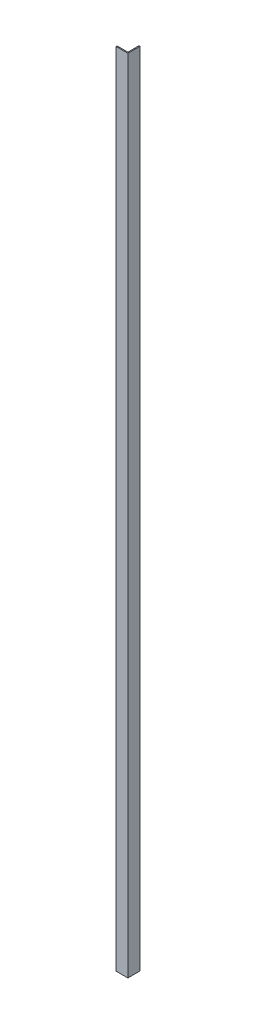
ISO-10303-21;
HEADER;
FILE_DESCRIPTION(('STEP AP214'),'2;1');
FILE_NAME('part.step','',(''),(''),'','','');
FILE_SCHEMA(('AUTOMOTIVE_DESIGN { 1 0 10303 214 1 1 1 1 }'));
ENDSEC;
DATA;
#1=APPLICATION_CONTEXT('core data for automotive mechanical design processes');
#2=APPLICATION_PROTOCOL_DEFINITION('international standard','automotive_design',2000,#1);
#3=PRODUCT_CONTEXT('',#1,'mechanical');
#4=PRODUCT('Part','Part','',(#3));
#5=PRODUCT_RELATED_PRODUCT_CATEGORY('part','',(#4));
#6=PRODUCT_DEFINITION_FORMATION('','',#4);
#7=PRODUCT_DEFINITION_CONTEXT('part definition',#1,'design');
#8=PRODUCT_DEFINITION('design','',#6,#7);
#9=PRODUCT_DEFINITION_SHAPE('','',#8);
#10=(LENGTH_UNIT() NAMED_UNIT(*) SI_UNIT(.MILLI.,.METRE.));
#11=(NAMED_UNIT(*) PLANE_ANGLE_UNIT() SI_UNIT($,.RADIAN.));
#12=(NAMED_UNIT(*) SI_UNIT($,.STERADIAN.) SOLID_ANGLE_UNIT());
#13=UNCERTAINTY_MEASURE_WITH_UNIT(LENGTH_MEASURE(1.E-05),#10,'distance_accuracy_value','');
#14=(GEOMETRIC_REPRESENTATION_CONTEXT(3) GLOBAL_UNCERTAINTY_ASSIGNED_CONTEXT((#13)) GLOBAL_UNIT_ASSIGNED_CONTEXT((#10,
#11,#12)) REPRESENTATION_CONTEXT('',''));
#15=CARTESIAN_POINT('',(0.,0.,0.));
#16=DIRECTION('',(0.,0.,1.));
#17=DIRECTION('',(1.,0.,0.));
#18=AXIS2_PLACEMENT_3D('',#15,#16,#17);
#19=CARTESIAN_POINT('',(0.,1220.,-1.5));
#20=DIRECTION('',(1.,0.,0.));
#21=DIRECTION('',(0.,0.,-1.));
#22=AXIS2_PLACEMENT_3D('',#19,#20,#21);
#23=PLANE('',#22);
#24=DIRECTION('',(0.,0.,1.));
#25=VECTOR('',#24,1.);
#26=CARTESIAN_POINT('',(0.,1220.,-1.5));
#27=LINE('',#26,#25);
#28=CARTESIAN_POINT('',(0.,1220.,-0.3));
#29=VERTEX_POINT('',#28);
#30=CARTESIAN_POINT('',(0.,1220.,0.));
#31=VERTEX_POINT('',#30);
#32=EDGE_CURVE('E117',#29,#31,#27,.T.);
#33=ORIENTED_EDGE('',*,*,#32,.F.);
#34=CARTESIAN_POINT('',(0.,-60.9999999999999,-0.3));
#35=CARTESIAN_POINT('',(0.,386.333333333333,-0.3));
#36=CARTESIAN_POINT('',(0.,833.666666666667,-0.3));
#37=CARTESIAN_POINT('',(0.,1281.,-0.3));
#38=(BOUNDED_CURVE() B_SPLINE_CURVE(3,(#34,#35,#36,#37),.UNSPECIFIED.,.F.,
.F.) B_SPLINE_CURVE_WITH_KNOTS((4,4),(-0.0609999999999999,1.281),
.UNSPECIFIED.) CURVE() GEOMETRIC_REPRESENTATION_ITEM() RATIONAL_B_SPLINE_CURVE((1.,1.,1.,1.)) REPRESENTATION_ITEM(''));
#39=CARTESIAN_POINT('',(0.,0.,-0.3));
#40=VERTEX_POINT('',#39);
#41=EDGE_CURVE('E231',#29,#40,#38,.F.);
#42=ORIENTED_EDGE('',*,*,#41,.T.);
#43=DIRECTION('',(0.,0.,1.));
#44=VECTOR('',#43,1.);
#45=CARTESIAN_POINT('',(0.,0.,-1.5));
#46=LINE('',#45,#44);
#47=CARTESIAN_POINT('',(0.,0.,0.));
#48=VERTEX_POINT('',#47);
#49=EDGE_CURVE('E139',#40,#48,#46,.T.);
#50=ORIENTED_EDGE('',*,*,#49,.T.);
#51=DIRECTION('',(0.,-1.,0.));
#52=VECTOR('',#51,1.);
#53=CARTESIAN_POINT('',(0.,1220.,0.));
#54=LINE('',#53,#52);
#55=EDGE_CURVE('E133',#31,#48,#54,.T.);
#56=ORIENTED_EDGE('',*,*,#55,.F.);
#57=EDGE_LOOP('',(#33,#42,#50,#56));
#58=FACE_BOUND('',#57,.T.);
#59=ADVANCED_FACE('F39',(#58),#23,.F.);
#60=CARTESIAN_POINT('',(0.,1220.,0.));
#61=DIRECTION('',(0.,0.,-1.));
#62=DIRECTION('',(-1.,0.,0.));
#63=AXIS2_PLACEMENT_3D('',#60,#61,#62);
#64=PLANE('',#63);
#65=DIRECTION('',(1.,0.,0.));
#66=VECTOR('',#65,1.);
#67=CARTESIAN_POINT('',(0.,0.,0.));
#68=LINE('',#67,#66);
#69=CARTESIAN_POINT('',(18.,0.,0.));
#70=VERTEX_POINT('',#69);
#71=EDGE_CURVE('E223',#48,#70,#68,.T.);
#72=ORIENTED_EDGE('',*,*,#71,.T.);
#73=DIRECTION('',(0.,-1.,0.));
#74=VECTOR('',#73,1.);
#75=CARTESIAN_POINT('',(18.,1220.,0.));
#76=LINE('',#75,#74);
#77=CARTESIAN_POINT('',(18.,1220.,0.));
#78=VERTEX_POINT('',#77);
#79=EDGE_CURVE('E135',#78,#70,#76,.T.);
#80=ORIENTED_EDGE('',*,*,#79,.F.);
#81=DIRECTION('',(1.,0.,0.));
#82=VECTOR('',#81,1.);
#83=CARTESIAN_POINT('',(0.,1220.,0.));
#84=LINE('',#83,#82);
#85=EDGE_CURVE('E120',#31,#78,#84,.T.);
#86=ORIENTED_EDGE('',*,*,#85,.F.);
#87=ORIENTED_EDGE('',*,*,#55,.T.);
#88=EDGE_LOOP('',(#72,#80,#86,#87));
#89=FACE_BOUND('',#88,.T.);
#90=ADVANCED_FACE('F132',(#89),#64,.F.);
#91=CARTESIAN_POINT('',(18.,1220.,0.));
#92=DIRECTION('',(-1.,0.,0.));
#93=DIRECTION('',(0.,0.,1.));
#94=AXIS2_PLACEMENT_3D('',#91,#92,#93);
#95=PLANE('',#94);
#96=DIRECTION('',(0.,0.,-1.));
#97=VECTOR('',#96,1.);
#98=CARTESIAN_POINT('',(18.,0.,0.));
#99=LINE('',#98,#97);
#100=CARTESIAN_POINT('',(18.,0.,-18.4212410874005));
#101=VERTEX_POINT('',#100);
#102=EDGE_CURVE('E237',#70,#101,#99,.T.);
#103=ORIENTED_EDGE('',*,*,#102,.T.);
#104=DIRECTION('',(0.,-1.,0.));
#105=VECTOR('',#104,1.);
#106=CARTESIAN_POINT('',(18.,1220.,-18.4212410874005));
#107=LINE('',#106,#105);
#108=CARTESIAN_POINT('',(18.,1220.,-18.4212410874005));
#109=VERTEX_POINT('',#108);
#110=EDGE_CURVE('E146',#109,#101,#107,.T.);
#111=ORIENTED_EDGE('',*,*,#110,.F.);
#112=DIRECTION('',(0.,0.,-1.));
#113=VECTOR('',#112,1.);
#114=CARTESIAN_POINT('',(18.,1220.,0.));
#115=LINE('',#114,#113);
#116=EDGE_CURVE('E137',#78,#109,#115,.T.);
#117=ORIENTED_EDGE('',*,*,#116,.F.);
#118=ORIENTED_EDGE('',*,*,#79,.T.);
#119=EDGE_LOOP('',(#103,#111,#117,#118));
#120=FACE_BOUND('',#119,.T.);
#121=ADVANCED_FACE('F262',(#120),#95,.F.);
#122=CARTESIAN_POINT('',(16.5,1220.,-18.4212410874005));
#123=DIRECTION('',(0.,0.,1.));
#124=DIRECTION('',(1.,0.,0.));
#125=AXIS2_PLACEMENT_3D('',#122,#123,#124);
#126=PLANE('',#125);
#127=DIRECTION('',(-1.,0.,0.));
#128=VECTOR('',#127,1.);
#129=CARTESIAN_POINT('',(16.5,0.,-18.4212410874005));
#130=LINE('',#129,#128);
#131=CARTESIAN_POINT('',(17.7,0.,-18.4212410874005));
#132=VERTEX_POINT('',#131);
#133=EDGE_CURVE('E161',#101,#132,#130,.T.);
#134=ORIENTED_EDGE('',*,*,#133,.T.);
#135=CARTESIAN_POINT('',(17.7,1281.,-18.4212410874005));
#136=CARTESIAN_POINT('',(17.7,833.666666666667,-18.4212410874005));
#137=CARTESIAN_POINT('',(17.7,386.333333333333,-18.4212410874005));
#138=CARTESIAN_POINT('',(17.7,-60.9999999999999,-18.4212410874005));
#139=(BOUNDED_CURVE() B_SPLINE_CURVE(3,(#135,#136,#137,#138),.UNSPECIFIED.,.F.,
.F.) B_SPLINE_CURVE_WITH_KNOTS((4,4),(-0.061,1.281),
.UNSPECIFIED.) CURVE() GEOMETRIC_REPRESENTATION_ITEM() RATIONAL_B_SPLINE_CURVE((1.,1.,1.,1.)) REPRESENTATION_ITEM(''));
#140=CARTESIAN_POINT('',(17.7,1220.,-18.4212410874005));
#141=VERTEX_POINT('',#140);
#142=EDGE_CURVE('E361',#132,#141,#139,.F.);
#143=ORIENTED_EDGE('',*,*,#142,.T.);
#144=DIRECTION('',(-1.,0.,0.));
#145=VECTOR('',#144,1.);
#146=CARTESIAN_POINT('',(16.5,1220.,-18.4212410874005));
#147=LINE('',#146,#145);
#148=EDGE_CURVE('E206',#109,#141,#147,.T.);
#149=ORIENTED_EDGE('',*,*,#148,.F.);
#150=ORIENTED_EDGE('',*,*,#110,.T.);
#151=EDGE_LOOP('',(#134,#143,#149,#150));
#152=FACE_BOUND('',#151,.T.);
#153=ADVANCED_FACE('F257',(#152),#126,.F.);
#154=CARTESIAN_POINT('',(16.5,1220.,-1.5));
#155=DIRECTION('',(1.,0.,0.));
#156=DIRECTION('',(0.,0.,-1.));
#157=AXIS2_PLACEMENT_3D('',#154,#155,#156);
#158=PLANE('',#157);
#159=DIRECTION('',(0.,0.,1.));
#160=VECTOR('',#159,1.);
#161=CARTESIAN_POINT('',(16.5,1220.,-1.5));
#162=LINE('',#161,#160);
#163=CARTESIAN_POINT('',(16.5,1220.,-16.4212410874005));
#164=VERTEX_POINT('',#163);
#165=CARTESIAN_POINT('',(16.5,1220.,-2.5));
#166=VERTEX_POINT('',#165);
#167=EDGE_CURVE('E162',#164,#166,#162,.T.);
#168=ORIENTED_EDGE('',*,*,#167,.F.);
#169=CARTESIAN_POINT('',(16.5,-60.9999999999999,-16.4212410874005));
#170=CARTESIAN_POINT('',(16.5,386.333333333333,-16.4212410874005));
#171=CARTESIAN_POINT('',(16.5,833.666666666667,-16.4212410874005));
#172=CARTESIAN_POINT('',(16.5,1281.,-16.4212410874005));
#173=(BOUNDED_CURVE() B_SPLINE_CURVE(3,(#169,#170,#171,#172),.UNSPECIFIED.,.F.,
.F.) B_SPLINE_CURVE_WITH_KNOTS((4,4),(-0.0609999999999999,1.281),
.UNSPECIFIED.) CURVE() GEOMETRIC_REPRESENTATION_ITEM() RATIONAL_B_SPLINE_CURVE((1.,1.,1.,1.)) REPRESENTATION_ITEM(''));
#174=CARTESIAN_POINT('',(16.5,0.,-16.4212410874005));
#175=VERTEX_POINT('',#174);
#176=EDGE_CURVE('E157',#164,#175,#173,.F.);
#177=ORIENTED_EDGE('',*,*,#176,.T.);
#178=DIRECTION('',(0.,0.,1.));
#179=VECTOR('',#178,1.);
#180=CARTESIAN_POINT('',(16.5,0.,-1.5));
#181=LINE('',#180,#179);
#182=CARTESIAN_POINT('',(16.5,0.,-2.5));
#183=VERTEX_POINT('',#182);
#184=EDGE_CURVE('E158',#175,#183,#181,.T.);
#185=ORIENTED_EDGE('',*,*,#184,.T.);
#186=DIRECTION('',(0.,-1.,0.));
#187=VECTOR('',#186,1.);
#188=CARTESIAN_POINT('',(16.5,1220.,-2.5));
#189=LINE('',#188,#187);
#190=EDGE_CURVE('E144',#183,#166,#189,.F.);
#191=ORIENTED_EDGE('',*,*,#190,.T.);
#192=EDGE_LOOP('',(#168,#177,#185,#191));
#193=FACE_BOUND('',#192,.T.);
#194=ADVANCED_FACE('F248',(#193),#158,.F.);
#195=CARTESIAN_POINT('',(0.,1220.,-1.5));
#196=DIRECTION('',(0.,0.,1.));
#197=DIRECTION('',(1.,0.,0.));
#198=AXIS2_PLACEMENT_3D('',#195,#196,#197);
#199=PLANE('',#198);
#200=DIRECTION('',(-1.,0.,0.));
#201=VECTOR('',#200,1.);
#202=CARTESIAN_POINT('',(0.,0.,-1.5));
#203=LINE('',#202,#201);
#204=CARTESIAN_POINT('',(15.5,0.,-1.5));
#205=VERTEX_POINT('',#204);
#206=CARTESIAN_POINT('',(2.,0.,-1.5));
#207=VERTEX_POINT('',#206);
#208=EDGE_CURVE('E128',#205,#207,#203,.T.);
#209=ORIENTED_EDGE('',*,*,#208,.T.);
#210=CARTESIAN_POINT('',(2.,1281.,-1.5));
#211=CARTESIAN_POINT('',(2.,833.666666666667,-1.5));
#212=CARTESIAN_POINT('',(2.,386.333333333333,-1.5));
#213=CARTESIAN_POINT('',(2.,-60.9999999999999,-1.5));
#214=(BOUNDED_CURVE() B_SPLINE_CURVE(3,(#210,#211,#212,#213),.UNSPECIFIED.,.F.,
.F.) B_SPLINE_CURVE_WITH_KNOTS((4,4),(-0.061,1.281),
.UNSPECIFIED.) CURVE() GEOMETRIC_REPRESENTATION_ITEM() RATIONAL_B_SPLINE_CURVE((1.,1.,1.,1.)) REPRESENTATION_ITEM(''));
#215=CARTESIAN_POINT('',(2.,1220.,-1.5));
#216=VERTEX_POINT('',#215);
#217=EDGE_CURVE('E53',#207,#216,#214,.F.);
#218=ORIENTED_EDGE('',*,*,#217,.T.);
#219=DIRECTION('',(-1.,0.,0.));
#220=VECTOR('',#219,1.);
#221=CARTESIAN_POINT('',(0.,1220.,-1.5));
#222=LINE('',#221,#220);
#223=CARTESIAN_POINT('',(15.5,1220.,-1.5));
#224=VERTEX_POINT('',#223);
#225=EDGE_CURVE('E182',#224,#216,#222,.T.);
#226=ORIENTED_EDGE('',*,*,#225,.F.);
#227=DIRECTION('',(0.,-1.,0.));
#228=VECTOR('',#227,1.);
#229=CARTESIAN_POINT('',(15.5,0.,-1.5));
#230=LINE('',#229,#228);
#231=EDGE_CURVE('E141',#224,#205,#230,.T.);
#232=ORIENTED_EDGE('',*,*,#231,.T.);
#233=EDGE_LOOP('',(#209,#218,#226,#232));
#234=FACE_BOUND('',#233,.T.);
#235=ADVANCED_FACE('F196',(#234),#199,.F.);
#236=CARTESIAN_POINT('',(0.,1220.,0.));
#237=DIRECTION('',(0.,1.,0.));
#238=DIRECTION('',(0.,0.,1.));
#239=AXIS2_PLACEMENT_3D('',#236,#237,#238);
#240=PLANE('',#239);
#241=ORIENTED_EDGE('',*,*,#225,.T.);
#242=CARTESIAN_POINT('',(0.,1220.,-0.3));
#243=CARTESIAN_POINT('',(0.,1220.,-1.5));
#244=CARTESIAN_POINT('',(2.,1220.,-1.5));
#245=(BOUNDED_CURVE() B_SPLINE_CURVE(2,(#242,#243,#244),.UNSPECIFIED.,.F.,
.F.) B_SPLINE_CURVE_WITH_KNOTS((3,3),(0.,1.),
.UNSPECIFIED.) CURVE() GEOMETRIC_REPRESENTATION_ITEM() RATIONAL_B_SPLINE_CURVE((1.,
0.707106781186548,1.)) REPRESENTATION_ITEM(''));
#246=EDGE_CURVE('E12',#216,#29,#245,.F.);
#247=ORIENTED_EDGE('',*,*,#246,.T.);
#248=ORIENTED_EDGE('',*,*,#32,.T.);
#249=ORIENTED_EDGE('',*,*,#85,.T.);
#250=ORIENTED_EDGE('',*,*,#116,.T.);
#251=ORIENTED_EDGE('',*,*,#148,.T.);
#252=CARTESIAN_POINT('',(16.5,1220.,-16.4212410874005));
#253=CARTESIAN_POINT('',(16.5,1220.,-18.4212410874005));
#254=CARTESIAN_POINT('',(17.7,1220.,-18.4212410874005));
#255=(BOUNDED_CURVE() B_SPLINE_CURVE(2,(#252,#253,#254),.UNSPECIFIED.,.F.,
.F.) B_SPLINE_CURVE_WITH_KNOTS((3,3),(0.,1.),
.UNSPECIFIED.) CURVE() GEOMETRIC_REPRESENTATION_ITEM() RATIONAL_B_SPLINE_CURVE((1.,
0.707106781186548,1.)) REPRESENTATION_ITEM(''));
#256=EDGE_CURVE('E234',#141,#164,#255,.F.);
#257=ORIENTED_EDGE('',*,*,#256,.T.);
#258=ORIENTED_EDGE('',*,*,#167,.T.);
#259=CARTESIAN_POINT('',(15.5,1220.,-2.5));
#260=DIRECTION('',(0.,1.,0.));
#261=DIRECTION('',(0.,0.,1.));
#262=AXIS2_PLACEMENT_3D('',#259,#260,#261);
#263=CIRCLE('',#262,1.);
#264=EDGE_CURVE('E155',#166,#224,#263,.F.);
#265=ORIENTED_EDGE('',*,*,#264,.T.);
#266=EDGE_LOOP('',(#241,#247,#248,#249,#250,#251,#257,#258,#265));
#267=FACE_BOUND('',#266,.T.);
#268=ADVANCED_FACE('F119',(#267),#240,.T.);
#269=CARTESIAN_POINT('',(0.,0.,0.));
#270=DIRECTION('',(0.,1.,0.));
#271=DIRECTION('',(0.,0.,1.));
#272=AXIS2_PLACEMENT_3D('',#269,#270,#271);
#273=PLANE('',#272);
#274=ORIENTED_EDGE('',*,*,#49,.F.);
#275=CARTESIAN_POINT('',(2.,0.,-1.5));
#276=CARTESIAN_POINT('',(0.,0.,-1.5));
#277=CARTESIAN_POINT('',(0.,0.,-0.3));
#278=(BOUNDED_CURVE() B_SPLINE_CURVE(2,(#275,#276,#277),.UNSPECIFIED.,.F.,
.F.) B_SPLINE_CURVE_WITH_KNOTS((3,3),(0.,1.),
.UNSPECIFIED.) CURVE() GEOMETRIC_REPRESENTATION_ITEM() RATIONAL_B_SPLINE_CURVE((1.,
0.707106781186548,1.)) REPRESENTATION_ITEM(''));
#279=EDGE_CURVE('E68',#40,#207,#278,.F.);
#280=ORIENTED_EDGE('',*,*,#279,.T.);
#281=ORIENTED_EDGE('',*,*,#208,.F.);
#282=CARTESIAN_POINT('',(15.5,0.,-2.5));
#283=DIRECTION('',(0.,1.,0.));
#284=DIRECTION('',(0.,0.,1.));
#285=AXIS2_PLACEMENT_3D('',#282,#283,#284);
#286=CIRCLE('',#285,1.);
#287=EDGE_CURVE('E152',#205,#183,#286,.T.);
#288=ORIENTED_EDGE('',*,*,#287,.T.);
#289=ORIENTED_EDGE('',*,*,#184,.F.);
#290=CARTESIAN_POINT('',(17.7,0.,-18.4212410874005));
#291=CARTESIAN_POINT('',(16.5,0.,-18.4212410874005));
#292=CARTESIAN_POINT('',(16.5,0.,-16.4212410874005));
#293=(BOUNDED_CURVE() B_SPLINE_CURVE(2,(#290,#291,#292),.UNSPECIFIED.,.F.,
.F.) B_SPLINE_CURVE_WITH_KNOTS((3,3),(0.,1.),
.UNSPECIFIED.) CURVE() GEOMETRIC_REPRESENTATION_ITEM() RATIONAL_B_SPLINE_CURVE((1.,
0.707106781186548,1.)) REPRESENTATION_ITEM(''));
#294=EDGE_CURVE('E286',#175,#132,#293,.F.);
#295=ORIENTED_EDGE('',*,*,#294,.T.);
#296=ORIENTED_EDGE('',*,*,#133,.F.);
#297=ORIENTED_EDGE('',*,*,#102,.F.);
#298=ORIENTED_EDGE('',*,*,#71,.F.);
#299=EDGE_LOOP('',(#274,#280,#281,#288,#289,#295,#296,#297,#298));
#300=FACE_BOUND('',#299,.T.);
#301=ADVANCED_FACE('F184',(#300),#273,.F.);
#302=CARTESIAN_POINT('',(15.5,1220.,-2.5));
#303=DIRECTION('',(0.,1.,0.));
#304=DIRECTION('',(0.,0.,1.));
#305=AXIS2_PLACEMENT_3D('',#302,#303,#304);
#306=CYLINDRICAL_SURFACE('',#305,1.);
#307=ORIENTED_EDGE('',*,*,#264,.F.);
#308=ORIENTED_EDGE('',*,*,#190,.F.);
#309=ORIENTED_EDGE('',*,*,#287,.F.);
#310=ORIENTED_EDGE('',*,*,#231,.F.);
#311=EDGE_LOOP('',(#307,#308,#309,#310));
#312=FACE_BOUND('',#311,.T.);
#313=ADVANCED_FACE('F194',(#312),#306,.F.);
#314=CARTESIAN_POINT('',(16.5,1281.,-16.4212410874005));
#315=CARTESIAN_POINT('',(16.5,833.666666666667,-16.4212410874005));
#316=CARTESIAN_POINT('',(16.5,386.333333333333,-16.4212410874005));
#317=CARTESIAN_POINT('',(16.5,-60.9999999999999,-16.4212410874005));
#318=CARTESIAN_POINT('',(16.5,1281.,-18.4212410874005));
#319=CARTESIAN_POINT('',(16.5,833.666666666667,-18.4212410874005));
#320=CARTESIAN_POINT('',(16.5,386.333333333333,-18.4212410874005));
#321=CARTESIAN_POINT('',(16.5,-60.9999999999999,-18.4212410874005));
#322=CARTESIAN_POINT('',(17.7,1281.,-18.4212410874005));
#323=CARTESIAN_POINT('',(17.7,833.666666666667,-18.4212410874005));
#324=CARTESIAN_POINT('',(17.7,386.333333333333,-18.4212410874005));
#325=CARTESIAN_POINT('',(17.7,-60.9999999999999,-18.4212410874005));
#326=(BOUNDED_SURFACE() B_SPLINE_SURFACE(2,3,((#314,#315,#316,#317),(#318,#319,#320,#321),(#322,
#323,#324,#325)),.UNSPECIFIED.,.F.,.F.,.F.) B_SPLINE_SURFACE_WITH_KNOTS((3,3),(4,4),(0.,1.),
(-0.061,1.281),.UNSPECIFIED.) GEOMETRIC_REPRESENTATION_ITEM() RATIONAL_B_SPLINE_SURFACE(((1.,1.,
1.,1.),(0.707106781186548,0.707106781186548,0.707106781186548,0.707106781186548),(1.,1.,1.,1.))) REPRESENTATION_ITEM('') SURFACE());
#327=ORIENTED_EDGE('',*,*,#256,.F.);
#328=ORIENTED_EDGE('',*,*,#142,.F.);
#329=ORIENTED_EDGE('',*,*,#294,.F.);
#330=ORIENTED_EDGE('',*,*,#176,.F.);
#331=EDGE_LOOP('',(#327,#328,#329,#330));
#332=FACE_BOUND('',#331,.T.);
#333=ADVANCED_FACE('F292',(#332),#326,.T.);
#334=CARTESIAN_POINT('',(0.,1281.,-0.3));
#335=CARTESIAN_POINT('',(0.,833.666666666667,-0.3));
#336=CARTESIAN_POINT('',(0.,386.333333333333,-0.3));
#337=CARTESIAN_POINT('',(0.,-60.9999999999999,-0.3));
#338=CARTESIAN_POINT('',(0.,1281.,-1.5));
#339=CARTESIAN_POINT('',(0.,833.666666666667,-1.5));
#340=CARTESIAN_POINT('',(0.,386.333333333333,-1.5));
#341=CARTESIAN_POINT('',(0.,-60.9999999999999,-1.5));
#342=CARTESIAN_POINT('',(2.,1281.,-1.5));
#343=CARTESIAN_POINT('',(2.,833.666666666667,-1.5));
#344=CARTESIAN_POINT('',(2.,386.333333333333,-1.5));
#345=CARTESIAN_POINT('',(2.,-60.9999999999999,-1.5));
#346=(BOUNDED_SURFACE() B_SPLINE_SURFACE(2,3,((#334,#335,#336,#337),(#338,#339,#340,#341),(#342,
#343,#344,#345)),.UNSPECIFIED.,.F.,.F.,.F.) B_SPLINE_SURFACE_WITH_KNOTS((3,3),(4,4),(0.,1.),
(-0.061,1.281),.UNSPECIFIED.) GEOMETRIC_REPRESENTATION_ITEM() RATIONAL_B_SPLINE_SURFACE(((1.,1.,
1.,1.),(0.707106781186548,0.707106781186548,0.707106781186548,0.707106781186548),(1.,1.,1.,1.))) REPRESENTATION_ITEM('') SURFACE());
#347=ORIENTED_EDGE('',*,*,#246,.F.);
#348=ORIENTED_EDGE('',*,*,#217,.F.);
#349=ORIENTED_EDGE('',*,*,#279,.F.);
#350=ORIENTED_EDGE('',*,*,#41,.F.);
#351=EDGE_LOOP('',(#347,#348,#349,#350));
#352=FACE_BOUND('',#351,.T.);
#353=ADVANCED_FACE('F42',(#352),#346,.T.);
#354=CLOSED_SHELL('',(#59,#90,#121,#153,#194,#235,#268,#301,#313,#333,#353));
#355=MANIFOLD_SOLID_BREP('B2',#354);
#356=ADVANCED_BREP_SHAPE_REPRESENTATION('',(#18,#355),#14);
#357=SHAPE_DEFINITION_REPRESENTATION(#9,#356);
ENDSEC;
END-ISO-10303-21;
